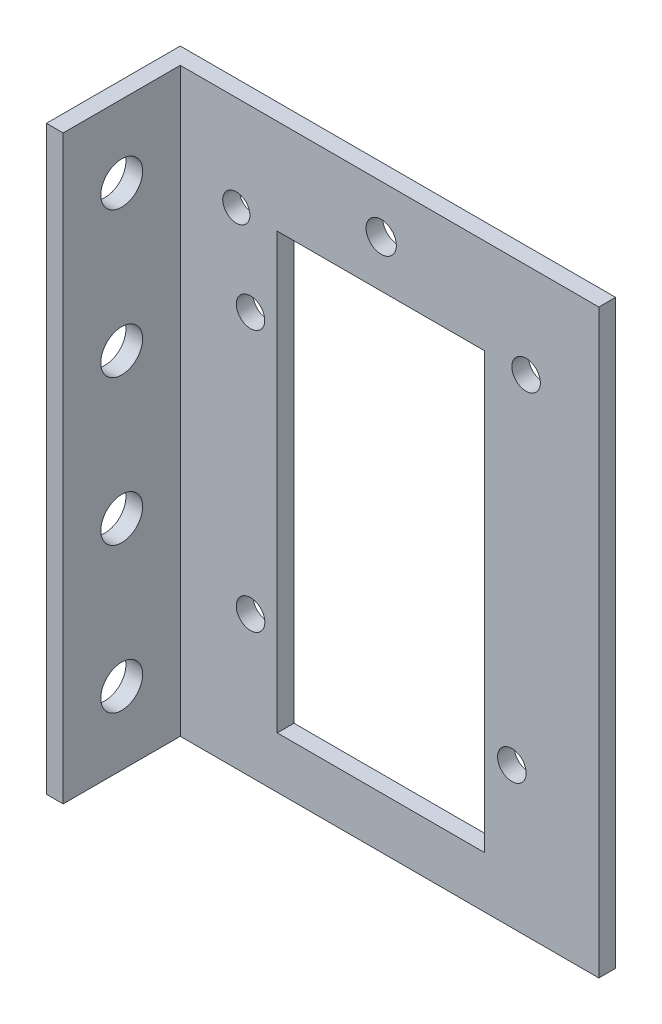
ISO-10303-21;
HEADER;
FILE_DESCRIPTION(('STEP AP214'),'2;1');
FILE_NAME('part.step','',(''),(''),'','','');
FILE_SCHEMA(('AUTOMOTIVE_DESIGN { 1 0 10303 214 1 1 1 1 }'));
ENDSEC;
DATA;
#1=APPLICATION_CONTEXT('core data for automotive mechanical design processes');
#2=APPLICATION_PROTOCOL_DEFINITION('international standard','automotive_design',2000,#1);
#3=PRODUCT_CONTEXT('',#1,'mechanical');
#4=PRODUCT('Part','Part','',(#3));
#5=PRODUCT_RELATED_PRODUCT_CATEGORY('part','',(#4));
#6=PRODUCT_DEFINITION_FORMATION('','',#4);
#7=PRODUCT_DEFINITION_CONTEXT('part definition',#1,'design');
#8=PRODUCT_DEFINITION('design','',#6,#7);
#9=PRODUCT_DEFINITION_SHAPE('','',#8);
#10=(LENGTH_UNIT() NAMED_UNIT(*) SI_UNIT(.MILLI.,.METRE.));
#11=(NAMED_UNIT(*) PLANE_ANGLE_UNIT() SI_UNIT($,.RADIAN.));
#12=(NAMED_UNIT(*) SI_UNIT($,.STERADIAN.) SOLID_ANGLE_UNIT());
#13=UNCERTAINTY_MEASURE_WITH_UNIT(LENGTH_MEASURE(1.E-05),#10,'distance_accuracy_value','');
#14=(GEOMETRIC_REPRESENTATION_CONTEXT(3) GLOBAL_UNCERTAINTY_ASSIGNED_CONTEXT((#13)) GLOBAL_UNIT_ASSIGNED_CONTEXT((#10,
#11,#12)) REPRESENTATION_CONTEXT('',''));
#15=CARTESIAN_POINT('',(0.,0.,0.));
#16=DIRECTION('',(0.,0.,1.));
#17=DIRECTION('',(1.,0.,0.));
#18=AXIS2_PLACEMENT_3D('',#15,#16,#17);
#19=CARTESIAN_POINT('',(0.,0.,2.54));
#20=DIRECTION('',(0.,0.,1.));
#21=DIRECTION('',(1.,0.,0.));
#22=AXIS2_PLACEMENT_3D('',#19,#20,#21);
#23=PLANE('',#22);
#24=DIRECTION('',(0.,1.,0.));
#25=VECTOR('',#24,1.);
#26=CARTESIAN_POINT('',(-30.5012288170116,41.9925598798662,2.54));
#27=LINE('',#26,#25);
#28=CARTESIAN_POINT('',(-30.5012288170116,-46.2230739168744,2.54));
#29=VERTEX_POINT('',#28);
#30=CARTESIAN_POINT('',(-30.5012288170116,41.9925598798662,2.54));
#31=VERTEX_POINT('',#30);
#32=EDGE_CURVE('E51',#29,#31,#27,.T.);
#33=ORIENTED_EDGE('',*,*,#32,.F.);
#34=DIRECTION('',(1.,0.,0.));
#35=VECTOR('',#34,1.);
#36=CARTESIAN_POINT('',(33.0412288170116,-46.2230739168744,2.54));
#37=LINE('',#36,#35);
#38=CARTESIAN_POINT('',(33.0412288170116,-46.2230739168744,2.54));
#39=VERTEX_POINT('',#38);
#40=EDGE_CURVE('E212',#29,#39,#37,.T.);
#41=ORIENTED_EDGE('',*,*,#40,.T.);
#42=DIRECTION('',(0.,1.,0.));
#43=VECTOR('',#42,1.);
#44=CARTESIAN_POINT('',(33.0412288170116,-38.4095276833772,2.54));
#45=LINE('',#44,#43);
#46=CARTESIAN_POINT('',(33.0412288170116,41.9925598798662,2.54));
#47=VERTEX_POINT('',#46);
#48=EDGE_CURVE('E214',#39,#47,#45,.T.);
#49=ORIENTED_EDGE('',*,*,#48,.T.);
#50=DIRECTION('',(-1.,0.,0.));
#51=VECTOR('',#50,1.);
#52=CARTESIAN_POINT('',(33.0412288170116,41.9925598798662,2.54));
#53=LINE('',#52,#51);
#54=EDGE_CURVE('E216',#47,#31,#53,.T.);
#55=ORIENTED_EDGE('',*,*,#54,.T.);
#56=EDGE_LOOP('',(#33,#41,#49,#55));
#57=FACE_BOUND('',#56,.T.);
#58=CARTESIAN_POINT('',(-19.8374,-24.8158,2.54));
#59=DIRECTION('',(0.,0.,1.));
#60=DIRECTION('',(1.,0.,0.));
#61=AXIS2_PLACEMENT_3D('',#58,#59,#60);
#62=CIRCLE('',#61,2.16872595803174);
#63=CARTESIAN_POINT('',(-17.6686740419683,-24.8158,2.54));
#64=VERTEX_POINT('',#63);
#65=EDGE_CURVE('E152',#64,#64,#62,.T.);
#66=ORIENTED_EDGE('',*,*,#65,.F.);
#67=EDGE_LOOP('',(#66));
#68=FACE_BOUND('',#67,.T.);
#69=CARTESIAN_POINT('',(-21.9964,27.559,2.54));
#70=DIRECTION('',(0.,0.,1.));
#71=DIRECTION('',(1.,0.,0.));
#72=AXIS2_PLACEMENT_3D('',#69,#70,#71);
#73=CIRCLE('',#72,2.0618135988808);
#74=CARTESIAN_POINT('',(-19.9345864011192,27.559,2.54));
#75=VERTEX_POINT('',#74);
#76=EDGE_CURVE('E164',#75,#75,#73,.T.);
#77=ORIENTED_EDGE('',*,*,#76,.F.);
#78=EDGE_LOOP('',(#77));
#79=FACE_BOUND('',#78,.T.);
#80=CARTESIAN_POINT('',(21.9960035519397,27.5585036576197,2.54));
#81=DIRECTION('',(0.,0.,1.));
#82=DIRECTION('',(1.,0.,0.));
#83=AXIS2_PLACEMENT_3D('',#80,#81,#82);
#84=CIRCLE('',#83,2.16872595803174);
#85=CARTESIAN_POINT('',(24.1647295099714,27.5585036576197,2.54));
#86=VERTEX_POINT('',#85);
#87=EDGE_CURVE('E206',#86,#86,#84,.T.);
#88=ORIENTED_EDGE('',*,*,#87,.F.);
#89=EDGE_LOOP('',(#88));
#90=FACE_BOUND('',#89,.T.);
#91=CARTESIAN_POINT('',(-0.000312071212666548,34.695463786362,2.54));
#92=DIRECTION('',(0.,0.,1.));
#93=DIRECTION('',(1.,0.,0.));
#94=AXIS2_PLACEMENT_3D('',#91,#92,#93);
#95=CIRCLE('',#94,2.29962656346597);
#96=CARTESIAN_POINT('',(2.29931449225331,34.695463786362,2.54));
#97=VERTEX_POINT('',#96);
#98=EDGE_CURVE('E200',#97,#97,#95,.T.);
#99=ORIENTED_EDGE('',*,*,#98,.F.);
#100=EDGE_LOOP('',(#99));
#101=FACE_BOUND('',#100,.T.);
#102=DIRECTION('',(0.,1.,0.));
#103=VECTOR('',#102,1.);
#104=CARTESIAN_POINT('',(15.6527923956193,9.67192495792368,2.54));
#105=LINE('',#104,#103);
#106=CARTESIAN_POINT('',(15.6527923956193,-38.4095276833772,2.54));
#107=VERTEX_POINT('',#106);
#108=CARTESIAN_POINT('',(15.6527923956193,27.5585036576197,2.54));
#109=VERTEX_POINT('',#108);
#110=EDGE_CURVE('E172',#107,#109,#105,.T.);
#111=ORIENTED_EDGE('',*,*,#110,.F.);
#112=DIRECTION('',(1.,0.,0.));
#113=VECTOR('',#112,1.);
#114=CARTESIAN_POINT('',(15.6527923956193,-38.4095276833772,2.54));
#115=LINE('',#114,#113);
#116=CARTESIAN_POINT('',(-15.7809255813126,-38.4095276833772,2.54));
#117=VERTEX_POINT('',#116);
#118=EDGE_CURVE('E170',#117,#107,#115,.T.);
#119=ORIENTED_EDGE('',*,*,#118,.F.);
#120=DIRECTION('',(0.,-1.,0.));
#121=VECTOR('',#120,1.);
#122=CARTESIAN_POINT('',(-15.7809255813126,9.67192495792368,2.54));
#123=LINE('',#122,#121);
#124=CARTESIAN_POINT('',(-15.7809255813126,27.5585036576197,2.54));
#125=VERTEX_POINT('',#124);
#126=EDGE_CURVE('E177',#125,#117,#123,.T.);
#127=ORIENTED_EDGE('',*,*,#126,.F.);
#128=DIRECTION('',(-1.,0.,0.));
#129=VECTOR('',#128,1.);
#130=CARTESIAN_POINT('',(15.6527923956193,27.5585036576197,2.54));
#131=LINE('',#130,#129);
#132=EDGE_CURVE('E175',#109,#125,#131,.T.);
#133=ORIENTED_EDGE('',*,*,#132,.F.);
#134=EDGE_LOOP('',(#111,#119,#127,#133));
#135=FACE_BOUND('',#134,.T.);
#136=CARTESIAN_POINT('',(-19.8374,14.859,2.54));
#137=DIRECTION('',(0.,0.,1.));
#138=DIRECTION('',(1.,0.,0.));
#139=AXIS2_PLACEMENT_3D('',#136,#137,#138);
#140=CIRCLE('',#139,2.159);
#141=CARTESIAN_POINT('',(-17.6784,14.859,2.54));
#142=VERTEX_POINT('',#141);
#143=EDGE_CURVE('E158',#142,#142,#140,.T.);
#144=ORIENTED_EDGE('',*,*,#143,.F.);
#145=EDGE_LOOP('',(#144));
#146=FACE_BOUND('',#145,.T.);
#147=CARTESIAN_POINT('',(19.8374,-24.8158,2.54));
#148=DIRECTION('',(0.,0.,1.));
#149=DIRECTION('',(1.,0.,0.));
#150=AXIS2_PLACEMENT_3D('',#147,#148,#149);
#151=CIRCLE('',#150,2.16872595803174);
#152=CARTESIAN_POINT('',(22.0061259580317,-24.8158,2.54));
#153=VERTEX_POINT('',#152);
#154=EDGE_CURVE('E146',#153,#153,#151,.T.);
#155=ORIENTED_EDGE('',*,*,#154,.F.);
#156=EDGE_LOOP('',(#155));
#157=FACE_BOUND('',#156,.T.);
#158=ADVANCED_FACE('F36',(#57,#68,#79,#90,#101,#135,#146,#157),#23,.T.);
#159=CARTESIAN_POINT('',(0.,0.,0.));
#160=DIRECTION('',(0.,0.,1.));
#161=DIRECTION('',(1.,0.,0.));
#162=AXIS2_PLACEMENT_3D('',#159,#160,#161);
#163=PLANE('',#162);
#164=CARTESIAN_POINT('',(-0.000312071212666548,34.695463786362,0.));
#165=DIRECTION('',(0.,0.,1.));
#166=DIRECTION('',(1.,0.,0.));
#167=AXIS2_PLACEMENT_3D('',#164,#165,#166);
#168=CIRCLE('',#167,2.29962656346597);
#169=CARTESIAN_POINT('',(2.29931449225331,34.695463786362,0.));
#170=VERTEX_POINT('',#169);
#171=EDGE_CURVE('E199',#170,#170,#168,.T.);
#172=ORIENTED_EDGE('',*,*,#171,.T.);
#173=EDGE_LOOP('',(#172));
#174=FACE_BOUND('',#173,.T.);
#175=CARTESIAN_POINT('',(21.9960035519397,27.5585036576197,0.));
#176=DIRECTION('',(0.,0.,1.));
#177=DIRECTION('',(1.,0.,0.));
#178=AXIS2_PLACEMENT_3D('',#175,#176,#177);
#179=CIRCLE('',#178,2.16872595803174);
#180=CARTESIAN_POINT('',(24.1647295099714,27.5585036576197,0.));
#181=VERTEX_POINT('',#180);
#182=EDGE_CURVE('E203',#181,#181,#179,.T.);
#183=ORIENTED_EDGE('',*,*,#182,.T.);
#184=EDGE_LOOP('',(#183));
#185=FACE_BOUND('',#184,.T.);
#186=DIRECTION('',(1.,0.,0.));
#187=VECTOR('',#186,1.);
#188=CARTESIAN_POINT('',(33.0412288170116,-46.2230739168744,0.));
#189=LINE('',#188,#187);
#190=CARTESIAN_POINT('',(-33.0412288170116,-46.2230739168744,0.));
#191=VERTEX_POINT('',#190);
#192=CARTESIAN_POINT('',(33.0412288170116,-46.2230739168744,0.));
#193=VERTEX_POINT('',#192);
#194=EDGE_CURVE('E209',#191,#193,#189,.T.);
#195=ORIENTED_EDGE('',*,*,#194,.F.);
#196=DIRECTION('',(0.,-1.,0.));
#197=VECTOR('',#196,1.);
#198=CARTESIAN_POINT('',(-33.0412288170116,37.6809,0.));
#199=LINE('',#198,#197);
#200=CARTESIAN_POINT('',(-33.0412288170116,41.9925598798662,0.));
#201=VERTEX_POINT('',#200);
#202=EDGE_CURVE('E117',#201,#191,#199,.T.);
#203=ORIENTED_EDGE('',*,*,#202,.F.);
#204=DIRECTION('',(-1.,0.,0.));
#205=VECTOR('',#204,1.);
#206=CARTESIAN_POINT('',(33.0412288170116,41.9925598798662,0.));
#207=LINE('',#206,#205);
#208=CARTESIAN_POINT('',(33.0412288170116,41.9925598798662,0.));
#209=VERTEX_POINT('',#208);
#210=EDGE_CURVE('E222',#209,#201,#207,.T.);
#211=ORIENTED_EDGE('',*,*,#210,.F.);
#212=DIRECTION('',(0.,1.,0.));
#213=VECTOR('',#212,1.);
#214=CARTESIAN_POINT('',(33.0412288170116,37.6809,0.));
#215=LINE('',#214,#213);
#216=EDGE_CURVE('E220',#193,#209,#215,.T.);
#217=ORIENTED_EDGE('',*,*,#216,.F.);
#218=EDGE_LOOP('',(#195,#203,#211,#217));
#219=FACE_BOUND('',#218,.T.);
#220=DIRECTION('',(1.,0.,0.));
#221=VECTOR('',#220,1.);
#222=CARTESIAN_POINT('',(15.6527923956193,-38.4095276833772,0.));
#223=LINE('',#222,#221);
#224=CARTESIAN_POINT('',(-15.7809255813126,-38.4095276833772,0.));
#225=VERTEX_POINT('',#224);
#226=CARTESIAN_POINT('',(15.6527923956193,-38.4095276833772,0.));
#227=VERTEX_POINT('',#226);
#228=EDGE_CURVE('E167',#225,#227,#223,.T.);
#229=ORIENTED_EDGE('',*,*,#228,.T.);
#230=DIRECTION('',(0.,1.,0.));
#231=VECTOR('',#230,1.);
#232=CARTESIAN_POINT('',(15.6527923956193,9.67192495792368,0.));
#233=LINE('',#232,#231);
#234=CARTESIAN_POINT('',(15.6527923956193,27.5585036576197,0.));
#235=VERTEX_POINT('',#234);
#236=EDGE_CURVE('E182',#227,#235,#233,.T.);
#237=ORIENTED_EDGE('',*,*,#236,.T.);
#238=DIRECTION('',(-1.,0.,0.));
#239=VECTOR('',#238,1.);
#240=CARTESIAN_POINT('',(-15.7809255813126,27.5585036576197,0.));
#241=LINE('',#240,#239);
#242=CARTESIAN_POINT('',(-15.7809255813126,27.5585036576197,0.));
#243=VERTEX_POINT('',#242);
#244=EDGE_CURVE('E185',#235,#243,#241,.T.);
#245=ORIENTED_EDGE('',*,*,#244,.T.);
#246=DIRECTION('',(0.,-1.,0.));
#247=VECTOR('',#246,1.);
#248=CARTESIAN_POINT('',(-15.7809255813126,-38.4095276833772,0.));
#249=LINE('',#248,#247);
#250=EDGE_CURVE('E173',#243,#225,#249,.T.);
#251=ORIENTED_EDGE('',*,*,#250,.T.);
#252=EDGE_LOOP('',(#229,#237,#245,#251));
#253=FACE_BOUND('',#252,.T.);
#254=CARTESIAN_POINT('',(-21.9964,27.559,0.));
#255=DIRECTION('',(0.,0.,1.));
#256=DIRECTION('',(1.,0.,0.));
#257=AXIS2_PLACEMENT_3D('',#254,#255,#256);
#258=CIRCLE('',#257,2.0618135988808);
#259=CARTESIAN_POINT('',(-19.9345864011192,27.559,0.));
#260=VERTEX_POINT('',#259);
#261=EDGE_CURVE('E161',#260,#260,#258,.T.);
#262=ORIENTED_EDGE('',*,*,#261,.T.);
#263=EDGE_LOOP('',(#262));
#264=FACE_BOUND('',#263,.T.);
#265=CARTESIAN_POINT('',(-19.8374,14.859,0.));
#266=DIRECTION('',(0.,0.,1.));
#267=DIRECTION('',(1.,0.,0.));
#268=AXIS2_PLACEMENT_3D('',#265,#266,#267);
#269=CIRCLE('',#268,2.159);
#270=CARTESIAN_POINT('',(-17.6784,14.859,0.));
#271=VERTEX_POINT('',#270);
#272=EDGE_CURVE('E155',#271,#271,#269,.T.);
#273=ORIENTED_EDGE('',*,*,#272,.T.);
#274=EDGE_LOOP('',(#273));
#275=FACE_BOUND('',#274,.T.);
#276=CARTESIAN_POINT('',(-19.8374,-24.8158,0.));
#277=DIRECTION('',(0.,0.,1.));
#278=DIRECTION('',(1.,0.,0.));
#279=AXIS2_PLACEMENT_3D('',#276,#277,#278);
#280=CIRCLE('',#279,2.16872595803174);
#281=CARTESIAN_POINT('',(-17.6686740419683,-24.8158,0.));
#282=VERTEX_POINT('',#281);
#283=EDGE_CURVE('E149',#282,#282,#280,.T.);
#284=ORIENTED_EDGE('',*,*,#283,.T.);
#285=EDGE_LOOP('',(#284));
#286=FACE_BOUND('',#285,.T.);
#287=CARTESIAN_POINT('',(19.8374,-24.8158,0.));
#288=DIRECTION('',(0.,0.,1.));
#289=DIRECTION('',(1.,0.,0.));
#290=AXIS2_PLACEMENT_3D('',#287,#288,#289);
#291=CIRCLE('',#290,2.16872595803174);
#292=CARTESIAN_POINT('',(22.0061259580317,-24.8158,0.));
#293=VERTEX_POINT('',#292);
#294=EDGE_CURVE('E145',#293,#293,#291,.T.);
#295=ORIENTED_EDGE('',*,*,#294,.T.);
#296=EDGE_LOOP('',(#295));
#297=FACE_BOUND('',#296,.T.);
#298=ADVANCED_FACE('F236',(#174,#185,#219,#253,#264,#275,#286,#297),#163,.F.);
#299=CARTESIAN_POINT('',(33.0412288170116,-46.2230739168744,2.54));
#300=DIRECTION('',(0.,1.,0.));
#301=DIRECTION('',(0.,0.,1.));
#302=AXIS2_PLACEMENT_3D('',#299,#300,#301);
#303=PLANE('',#302);
#304=ORIENTED_EDGE('',*,*,#194,.T.);
#305=DIRECTION('',(0.,0.,-1.));
#306=VECTOR('',#305,1.);
#307=CARTESIAN_POINT('',(33.0412288170116,-46.2230739168744,2.54));
#308=LINE('',#307,#306);
#309=EDGE_CURVE('E44',#39,#193,#308,.T.);
#310=ORIENTED_EDGE('',*,*,#309,.F.);
#311=ORIENTED_EDGE('',*,*,#40,.F.);
#312=DIRECTION('',(0.,0.,-1.));
#313=VECTOR('',#312,1.);
#314=CARTESIAN_POINT('',(-30.5012288170116,-46.2230739168744,20.32));
#315=LINE('',#314,#313);
#316=CARTESIAN_POINT('',(-30.5012288170116,-46.2230739168744,20.32));
#317=VERTEX_POINT('',#316);
#318=EDGE_CURVE('E124',#317,#29,#315,.T.);
#319=ORIENTED_EDGE('',*,*,#318,.F.);
#320=DIRECTION('',(1.,0.,0.));
#321=VECTOR('',#320,1.);
#322=CARTESIAN_POINT('',(-33.0412288170116,-46.2230739168744,20.32));
#323=LINE('',#322,#321);
#324=CARTESIAN_POINT('',(-33.0412288170116,-46.2230739168744,20.32));
#325=VERTEX_POINT('',#324);
#326=EDGE_CURVE('E122',#325,#317,#323,.T.);
#327=ORIENTED_EDGE('',*,*,#326,.F.);
#328=DIRECTION('',(0.,0.,-1.));
#329=VECTOR('',#328,1.);
#330=CARTESIAN_POINT('',(-33.0412288170116,-46.2230739168744,2.54));
#331=LINE('',#330,#329);
#332=EDGE_CURVE('E11',#325,#191,#331,.T.);
#333=ORIENTED_EDGE('',*,*,#332,.T.);
#334=EDGE_LOOP('',(#304,#310,#311,#319,#327,#333));
#335=FACE_BOUND('',#334,.T.);
#336=ADVANCED_FACE('F38',(#335),#303,.F.);
#337=CARTESIAN_POINT('',(33.0412288170116,37.6809,2.54));
#338=DIRECTION('',(-1.,0.,0.));
#339=DIRECTION('',(0.,0.,1.));
#340=AXIS2_PLACEMENT_3D('',#337,#338,#339);
#341=PLANE('',#340);
#342=ORIENTED_EDGE('',*,*,#216,.T.);
#343=DIRECTION('',(0.,0.,-1.));
#344=VECTOR('',#343,1.);
#345=CARTESIAN_POINT('',(33.0412288170116,41.9925598798662,2.54));
#346=LINE('',#345,#344);
#347=EDGE_CURVE('E227',#47,#209,#346,.T.);
#348=ORIENTED_EDGE('',*,*,#347,.F.);
#349=ORIENTED_EDGE('',*,*,#48,.F.);
#350=ORIENTED_EDGE('',*,*,#309,.T.);
#351=EDGE_LOOP('',(#342,#348,#349,#350));
#352=FACE_BOUND('',#351,.T.);
#353=ADVANCED_FACE('F233',(#352),#341,.F.);
#354=CARTESIAN_POINT('',(33.0412288170116,41.9925598798662,2.54));
#355=DIRECTION('',(0.,-1.,0.));
#356=DIRECTION('',(0.,0.,-1.));
#357=AXIS2_PLACEMENT_3D('',#354,#355,#356);
#358=PLANE('',#357);
#359=ORIENTED_EDGE('',*,*,#210,.T.);
#360=DIRECTION('',(0.,0.,-1.));
#361=VECTOR('',#360,1.);
#362=CARTESIAN_POINT('',(-33.0412288170116,41.9925598798662,2.54));
#363=LINE('',#362,#361);
#364=CARTESIAN_POINT('',(-33.0412288170116,41.9925598798662,20.32));
#365=VERTEX_POINT('',#364);
#366=EDGE_CURVE('E218',#365,#201,#363,.T.);
#367=ORIENTED_EDGE('',*,*,#366,.F.);
#368=DIRECTION('',(-1.,0.,0.));
#369=VECTOR('',#368,1.);
#370=CARTESIAN_POINT('',(-33.0412288170116,41.9925598798662,20.32));
#371=LINE('',#370,#369);
#372=CARTESIAN_POINT('',(-30.5012288170116,41.9925598798662,20.32));
#373=VERTEX_POINT('',#372);
#374=EDGE_CURVE('E132',#373,#365,#371,.T.);
#375=ORIENTED_EDGE('',*,*,#374,.F.);
#376=DIRECTION('',(0.,0.,-1.));
#377=VECTOR('',#376,1.);
#378=CARTESIAN_POINT('',(-30.5012288170116,41.9925598798662,20.32));
#379=LINE('',#378,#377);
#380=EDGE_CURVE('E140',#373,#31,#379,.T.);
#381=ORIENTED_EDGE('',*,*,#380,.T.);
#382=ORIENTED_EDGE('',*,*,#54,.F.);
#383=ORIENTED_EDGE('',*,*,#347,.T.);
#384=EDGE_LOOP('',(#359,#367,#375,#381,#382,#383));
#385=FACE_BOUND('',#384,.T.);
#386=ADVANCED_FACE('F240',(#385),#358,.F.);
#387=CARTESIAN_POINT('',(-33.0412288170116,37.6809,2.54));
#388=DIRECTION('',(1.,0.,0.));
#389=DIRECTION('',(0.,0.,-1.));
#390=AXIS2_PLACEMENT_3D('',#387,#388,#389);
#391=PLANE('',#390);
#392=CARTESIAN_POINT('',(-33.0412288170116,-35.1961196922818,11.43));
#393=DIRECTION('',(1.,0.,0.));
#394=DIRECTION('',(0.,0.,-1.));
#395=AXIS2_PLACEMENT_3D('',#392,#393,#394);
#396=CIRCLE('',#395,3.175);
#397=CARTESIAN_POINT('',(-33.0412288170116,-35.1961196922818,8.255));
#398=VERTEX_POINT('',#397);
#399=EDGE_CURVE('E134',#398,#398,#396,.T.);
#400=ORIENTED_EDGE('',*,*,#399,.T.);
#401=EDGE_LOOP('',(#400));
#402=FACE_BOUND('',#401,.T.);
#403=CARTESIAN_POINT('',(-33.0412288170116,-13.1422112430967,11.43));
#404=DIRECTION('',(1.,0.,0.));
#405=DIRECTION('',(0.,0.,-1.));
#406=AXIS2_PLACEMENT_3D('',#403,#404,#405);
#407=CIRCLE('',#406,3.175);
#408=CARTESIAN_POINT('',(-33.0412288170116,-13.1422112430967,8.255));
#409=VERTEX_POINT('',#408);
#410=EDGE_CURVE('E471',#409,#409,#407,.T.);
#411=ORIENTED_EDGE('',*,*,#410,.T.);
#412=EDGE_LOOP('',(#411));
#413=FACE_BOUND('',#412,.T.);
#414=CARTESIAN_POINT('',(-33.0412288170116,8.91169720608844,11.43));
#415=DIRECTION('',(1.,0.,0.));
#416=DIRECTION('',(0.,0.,-1.));
#417=AXIS2_PLACEMENT_3D('',#414,#415,#416);
#418=CIRCLE('',#417,3.175);
#419=CARTESIAN_POINT('',(-33.0412288170116,8.91169720608844,8.25499999999998));
#420=VERTEX_POINT('',#419);
#421=EDGE_CURVE('E473',#420,#420,#418,.T.);
#422=ORIENTED_EDGE('',*,*,#421,.T.);
#423=EDGE_LOOP('',(#422));
#424=FACE_BOUND('',#423,.T.);
#425=CARTESIAN_POINT('',(-33.0412288170116,30.9656056552736,11.4299999999999));
#426=DIRECTION('',(1.,0.,0.));
#427=DIRECTION('',(0.,0.,-1.));
#428=AXIS2_PLACEMENT_3D('',#425,#426,#427);
#429=CIRCLE('',#428,3.175);
#430=CARTESIAN_POINT('',(-33.0412288170116,30.9656056552736,8.25499999999995));
#431=VERTEX_POINT('',#430);
#432=EDGE_CURVE('E477',#431,#431,#429,.T.);
#433=ORIENTED_EDGE('',*,*,#432,.T.);
#434=EDGE_LOOP('',(#433));
#435=FACE_BOUND('',#434,.T.);
#436=ORIENTED_EDGE('',*,*,#202,.T.);
#437=ORIENTED_EDGE('',*,*,#332,.F.);
#438=DIRECTION('',(0.,-1.,0.));
#439=VECTOR('',#438,1.);
#440=CARTESIAN_POINT('',(-33.0412288170116,41.9925598798662,20.32));
#441=LINE('',#440,#439);
#442=EDGE_CURVE('E116',#365,#325,#441,.T.);
#443=ORIENTED_EDGE('',*,*,#442,.F.);
#444=ORIENTED_EDGE('',*,*,#366,.T.);
#445=EDGE_LOOP('',(#436,#437,#443,#444));
#446=FACE_BOUND('',#445,.T.);
#447=ADVANCED_FACE('F113',(#402,#413,#424,#435,#446),#391,.F.);
#448=CARTESIAN_POINT('',(21.9960035519397,27.5585036576197,2.54));
#449=DIRECTION('',(0.,0.,-1.));
#450=DIRECTION('',(-1.,0.,0.));
#451=AXIS2_PLACEMENT_3D('',#448,#449,#450);
#452=CYLINDRICAL_SURFACE('',#451,2.16872595803174);
#453=ORIENTED_EDGE('',*,*,#87,.T.);
#454=EDGE_LOOP('',(#453));
#455=FACE_BOUND('',#454,.T.);
#456=ORIENTED_EDGE('',*,*,#182,.F.);
#457=EDGE_LOOP('',(#456));
#458=FACE_BOUND('',#457,.T.);
#459=ADVANCED_FACE('F269',(#455,#458),#452,.F.);
#460=CARTESIAN_POINT('',(-0.000312071212666548,34.695463786362,2.54));
#461=DIRECTION('',(0.,0.,-1.));
#462=DIRECTION('',(-1.,0.,0.));
#463=AXIS2_PLACEMENT_3D('',#460,#461,#462);
#464=CYLINDRICAL_SURFACE('',#463,2.29962656346597);
#465=ORIENTED_EDGE('',*,*,#98,.T.);
#466=EDGE_LOOP('',(#465));
#467=FACE_BOUND('',#466,.T.);
#468=ORIENTED_EDGE('',*,*,#171,.F.);
#469=EDGE_LOOP('',(#468));
#470=FACE_BOUND('',#469,.T.);
#471=ADVANCED_FACE('F304',(#467,#470),#464,.F.);
#472=CARTESIAN_POINT('',(15.6527923956193,-38.4095276833772,2.54));
#473=DIRECTION('',(0.,1.,0.));
#474=DIRECTION('',(0.,0.,1.));
#475=AXIS2_PLACEMENT_3D('',#472,#473,#474);
#476=PLANE('',#475);
#477=ORIENTED_EDGE('',*,*,#228,.F.);
#478=DIRECTION('',(0.,0.,-1.));
#479=VECTOR('',#478,1.);
#480=CARTESIAN_POINT('',(-15.7809255813126,-38.4095276833772,2.54));
#481=LINE('',#480,#479);
#482=EDGE_CURVE('E179',#117,#225,#481,.T.);
#483=ORIENTED_EDGE('',*,*,#482,.F.);
#484=ORIENTED_EDGE('',*,*,#118,.T.);
#485=DIRECTION('',(0.,0.,-1.));
#486=VECTOR('',#485,1.);
#487=CARTESIAN_POINT('',(15.6527923956193,-38.4095276833772,2.54));
#488=LINE('',#487,#486);
#489=EDGE_CURVE('E196',#107,#227,#488,.T.);
#490=ORIENTED_EDGE('',*,*,#489,.T.);
#491=EDGE_LOOP('',(#477,#483,#484,#490));
#492=FACE_BOUND('',#491,.T.);
#493=ADVANCED_FACE('F314',(#492),#476,.T.);
#494=CARTESIAN_POINT('',(15.6527923956193,9.67192495792368,2.54));
#495=DIRECTION('',(-1.,0.,0.));
#496=DIRECTION('',(0.,0.,1.));
#497=AXIS2_PLACEMENT_3D('',#494,#495,#496);
#498=PLANE('',#497);
#499=ORIENTED_EDGE('',*,*,#236,.F.);
#500=ORIENTED_EDGE('',*,*,#489,.F.);
#501=ORIENTED_EDGE('',*,*,#110,.T.);
#502=DIRECTION('',(0.,0.,-1.));
#503=VECTOR('',#502,1.);
#504=CARTESIAN_POINT('',(15.6527923956193,27.5585036576197,2.54));
#505=LINE('',#504,#503);
#506=EDGE_CURVE('E193',#109,#235,#505,.T.);
#507=ORIENTED_EDGE('',*,*,#506,.T.);
#508=EDGE_LOOP('',(#499,#500,#501,#507));
#509=FACE_BOUND('',#508,.T.);
#510=ADVANCED_FACE('F323',(#509),#498,.T.);
#511=CARTESIAN_POINT('',(-15.7809255813126,27.5585036576197,2.54));
#512=DIRECTION('',(0.,-1.,0.));
#513=DIRECTION('',(0.,0.,-1.));
#514=AXIS2_PLACEMENT_3D('',#511,#512,#513);
#515=PLANE('',#514);
#516=ORIENTED_EDGE('',*,*,#244,.F.);
#517=ORIENTED_EDGE('',*,*,#506,.F.);
#518=ORIENTED_EDGE('',*,*,#132,.T.);
#519=DIRECTION('',(0.,0.,-1.));
#520=VECTOR('',#519,1.);
#521=CARTESIAN_POINT('',(-15.7809255813126,27.5585036576197,2.54));
#522=LINE('',#521,#520);
#523=EDGE_CURVE('E59',#125,#243,#522,.T.);
#524=ORIENTED_EDGE('',*,*,#523,.T.);
#525=EDGE_LOOP('',(#516,#517,#518,#524));
#526=FACE_BOUND('',#525,.T.);
#527=ADVANCED_FACE('F334',(#526),#515,.T.);
#528=CARTESIAN_POINT('',(-15.7809255813126,-38.4095276833772,2.54));
#529=DIRECTION('',(1.,0.,0.));
#530=DIRECTION('',(0.,0.,-1.));
#531=AXIS2_PLACEMENT_3D('',#528,#529,#530);
#532=PLANE('',#531);
#533=ORIENTED_EDGE('',*,*,#250,.F.);
#534=ORIENTED_EDGE('',*,*,#523,.F.);
#535=ORIENTED_EDGE('',*,*,#126,.T.);
#536=ORIENTED_EDGE('',*,*,#482,.T.);
#537=EDGE_LOOP('',(#533,#534,#535,#536));
#538=FACE_BOUND('',#537,.T.);
#539=ADVANCED_FACE('F345',(#538),#532,.T.);
#540=CARTESIAN_POINT('',(-21.9964,27.559,2.54));
#541=DIRECTION('',(0.,0.,-1.));
#542=DIRECTION('',(-1.,0.,0.));
#543=AXIS2_PLACEMENT_3D('',#540,#541,#542);
#544=CYLINDRICAL_SURFACE('',#543,2.0618135988808);
#545=ORIENTED_EDGE('',*,*,#76,.T.);
#546=EDGE_LOOP('',(#545));
#547=FACE_BOUND('',#546,.T.);
#548=ORIENTED_EDGE('',*,*,#261,.F.);
#549=EDGE_LOOP('',(#548));
#550=FACE_BOUND('',#549,.T.);
#551=ADVANCED_FACE('F356',(#547,#550),#544,.F.);
#552=CARTESIAN_POINT('',(-19.8374,14.859,2.54));
#553=DIRECTION('',(0.,0.,-1.));
#554=DIRECTION('',(-1.,0.,0.));
#555=AXIS2_PLACEMENT_3D('',#552,#553,#554);
#556=CYLINDRICAL_SURFACE('',#555,2.159);
#557=ORIENTED_EDGE('',*,*,#143,.T.);
#558=EDGE_LOOP('',(#557));
#559=FACE_BOUND('',#558,.T.);
#560=ORIENTED_EDGE('',*,*,#272,.F.);
#561=EDGE_LOOP('',(#560));
#562=FACE_BOUND('',#561,.T.);
#563=ADVANCED_FACE('F365',(#559,#562),#556,.F.);
#564=CARTESIAN_POINT('',(-19.8374,-24.8158,2.54));
#565=DIRECTION('',(0.,0.,-1.));
#566=DIRECTION('',(-1.,0.,0.));
#567=AXIS2_PLACEMENT_3D('',#564,#565,#566);
#568=CYLINDRICAL_SURFACE('',#567,2.16872595803174);
#569=ORIENTED_EDGE('',*,*,#65,.T.);
#570=EDGE_LOOP('',(#569));
#571=FACE_BOUND('',#570,.T.);
#572=ORIENTED_EDGE('',*,*,#283,.F.);
#573=EDGE_LOOP('',(#572));
#574=FACE_BOUND('',#573,.T.);
#575=ADVANCED_FACE('F256',(#571,#574),#568,.F.);
#576=CARTESIAN_POINT('',(19.8374,-24.8158,2.54));
#577=DIRECTION('',(0.,0.,-1.));
#578=DIRECTION('',(-1.,0.,0.));
#579=AXIS2_PLACEMENT_3D('',#576,#577,#578);
#580=CYLINDRICAL_SURFACE('',#579,2.16872595803174);
#581=ORIENTED_EDGE('',*,*,#154,.T.);
#582=EDGE_LOOP('',(#581));
#583=FACE_BOUND('',#582,.T.);
#584=ORIENTED_EDGE('',*,*,#294,.F.);
#585=EDGE_LOOP('',(#584));
#586=FACE_BOUND('',#585,.T.);
#587=ADVANCED_FACE('F247',(#583,#586),#580,.F.);
#588=CARTESIAN_POINT('',(-30.5012288170116,41.9925598798662,20.32));
#589=DIRECTION('',(-1.,0.,0.));
#590=DIRECTION('',(0.,-1.,0.));
#591=AXIS2_PLACEMENT_3D('',#588,#589,#590);
#592=PLANE('',#591);
#593=CARTESIAN_POINT('',(-30.5012288170116,-35.1961196922818,11.43));
#594=DIRECTION('',(1.,0.,0.));
#595=DIRECTION('',(0.,1.,0.));
#596=AXIS2_PLACEMENT_3D('',#593,#594,#595);
#597=CIRCLE('',#596,3.175);
#598=CARTESIAN_POINT('',(-30.5012288170116,-32.0211196922818,11.43));
#599=VERTEX_POINT('',#598);
#600=EDGE_CURVE('E468',#599,#599,#597,.T.);
#601=ORIENTED_EDGE('',*,*,#600,.F.);
#602=EDGE_LOOP('',(#601));
#603=FACE_BOUND('',#602,.T.);
#604=CARTESIAN_POINT('',(-30.5012288170116,-13.1422112430967,11.43));
#605=DIRECTION('',(1.,0.,0.));
#606=DIRECTION('',(0.,-1.,0.));
#607=AXIS2_PLACEMENT_3D('',#604,#605,#606);
#608=CIRCLE('',#607,3.175);
#609=CARTESIAN_POINT('',(-30.5012288170116,-16.3172112430967,11.43));
#610=VERTEX_POINT('',#609);
#611=EDGE_CURVE('E488',#610,#610,#608,.T.);
#612=ORIENTED_EDGE('',*,*,#611,.F.);
#613=EDGE_LOOP('',(#612));
#614=FACE_BOUND('',#613,.T.);
#615=CARTESIAN_POINT('',(-30.5012288170116,8.91169720608844,11.43));
#616=DIRECTION('',(1.,0.,0.));
#617=DIRECTION('',(0.,1.,0.));
#618=AXIS2_PLACEMENT_3D('',#615,#616,#617);
#619=CIRCLE('',#618,3.175);
#620=CARTESIAN_POINT('',(-30.5012288170116,12.0866972060884,11.43));
#621=VERTEX_POINT('',#620);
#622=EDGE_CURVE('E485',#621,#621,#619,.T.);
#623=ORIENTED_EDGE('',*,*,#622,.F.);
#624=EDGE_LOOP('',(#623));
#625=FACE_BOUND('',#624,.T.);
#626=CARTESIAN_POINT('',(-30.5012288170116,30.9656056552736,11.4299999999999));
#627=DIRECTION('',(1.,0.,0.));
#628=DIRECTION('',(0.,-1.,0.));
#629=AXIS2_PLACEMENT_3D('',#626,#627,#628);
#630=CIRCLE('',#629,3.175);
#631=CARTESIAN_POINT('',(-30.5012288170116,27.7906056552736,11.4299999999999));
#632=VERTEX_POINT('',#631);
#633=EDGE_CURVE('E482',#632,#632,#630,.T.);
#634=ORIENTED_EDGE('',*,*,#633,.F.);
#635=EDGE_LOOP('',(#634));
#636=FACE_BOUND('',#635,.T.);
#637=ORIENTED_EDGE('',*,*,#32,.T.);
#638=ORIENTED_EDGE('',*,*,#380,.F.);
#639=DIRECTION('',(0.,1.,0.));
#640=VECTOR('',#639,1.);
#641=CARTESIAN_POINT('',(-30.5012288170116,41.9925598798662,20.32));
#642=LINE('',#641,#640);
#643=EDGE_CURVE('E127',#317,#373,#642,.T.);
#644=ORIENTED_EDGE('',*,*,#643,.F.);
#645=ORIENTED_EDGE('',*,*,#318,.T.);
#646=EDGE_LOOP('',(#637,#638,#644,#645));
#647=FACE_BOUND('',#646,.T.);
#648=ADVANCED_FACE('F245',(#603,#614,#625,#636,#647),#592,.F.);
#649=CARTESIAN_POINT('',(0.,0.,20.32));
#650=DIRECTION('',(0.,0.,1.));
#651=DIRECTION('',(1.,0.,0.));
#652=AXIS2_PLACEMENT_3D('',#649,#650,#651);
#653=PLANE('',#652);
#654=ORIENTED_EDGE('',*,*,#442,.T.);
#655=ORIENTED_EDGE('',*,*,#326,.T.);
#656=ORIENTED_EDGE('',*,*,#643,.T.);
#657=ORIENTED_EDGE('',*,*,#374,.T.);
#658=EDGE_LOOP('',(#654,#655,#656,#657));
#659=FACE_BOUND('',#658,.T.);
#660=ADVANCED_FACE('F130',(#659),#653,.T.);
#661=CARTESIAN_POINT('',(-48.2812288170116,30.9656056552736,11.4299999999999));
#662=DIRECTION('',(1.,0.,0.));
#663=DIRECTION('',(0.,1.,0.));
#664=AXIS2_PLACEMENT_3D('',#661,#662,#663);
#665=CYLINDRICAL_SURFACE('',#664,3.175);
#666=ORIENTED_EDGE('',*,*,#633,.T.);
#667=EDGE_LOOP('',(#666));
#668=FACE_BOUND('',#667,.T.);
#669=ORIENTED_EDGE('',*,*,#432,.F.);
#670=EDGE_LOOP('',(#669));
#671=FACE_BOUND('',#670,.T.);
#672=ADVANCED_FACE('F254',(#668,#671),#665,.F.);
#673=CARTESIAN_POINT('',(-48.2812288170116,8.91169720608844,11.43));
#674=DIRECTION('',(1.,0.,0.));
#675=DIRECTION('',(0.,1.,0.));
#676=AXIS2_PLACEMENT_3D('',#673,#674,#675);
#677=CYLINDRICAL_SURFACE('',#676,3.175);
#678=ORIENTED_EDGE('',*,*,#622,.T.);
#679=EDGE_LOOP('',(#678));
#680=FACE_BOUND('',#679,.T.);
#681=ORIENTED_EDGE('',*,*,#421,.F.);
#682=EDGE_LOOP('',(#681));
#683=FACE_BOUND('',#682,.T.);
#684=ADVANCED_FACE('F432',(#680,#683),#677,.F.);
#685=CARTESIAN_POINT('',(-48.2812288170116,-13.1422112430967,11.43));
#686=DIRECTION('',(1.,0.,0.));
#687=DIRECTION('',(0.,1.,0.));
#688=AXIS2_PLACEMENT_3D('',#685,#686,#687);
#689=CYLINDRICAL_SURFACE('',#688,3.175);
#690=ORIENTED_EDGE('',*,*,#611,.T.);
#691=EDGE_LOOP('',(#690));
#692=FACE_BOUND('',#691,.T.);
#693=ORIENTED_EDGE('',*,*,#410,.F.);
#694=EDGE_LOOP('',(#693));
#695=FACE_BOUND('',#694,.T.);
#696=ADVANCED_FACE('F441',(#692,#695),#689,.F.);
#697=CARTESIAN_POINT('',(-48.2812288170116,-35.1961196922818,11.43));
#698=DIRECTION('',(1.,0.,0.));
#699=DIRECTION('',(0.,1.,0.));
#700=AXIS2_PLACEMENT_3D('',#697,#698,#699);
#701=CYLINDRICAL_SURFACE('',#700,3.175);
#702=ORIENTED_EDGE('',*,*,#600,.T.);
#703=EDGE_LOOP('',(#702));
#704=FACE_BOUND('',#703,.T.);
#705=ORIENTED_EDGE('',*,*,#399,.F.);
#706=EDGE_LOOP('',(#705));
#707=FACE_BOUND('',#706,.T.);
#708=ADVANCED_FACE('F450',(#704,#707),#701,.F.);
#709=CLOSED_SHELL('',(#158,#298,#336,#353,#386,#447,#459,#471,#493,#510,#527,#539,#551,#563,
#575,#587,#648,#660,#672,#684,#696,#708));
#710=MANIFOLD_SOLID_BREP('B2',#709);
#711=ADVANCED_BREP_SHAPE_REPRESENTATION('',(#18,#710),#14);
#712=SHAPE_DEFINITION_REPRESENTATION(#9,#711);
ENDSEC;
END-ISO-10303-21;
